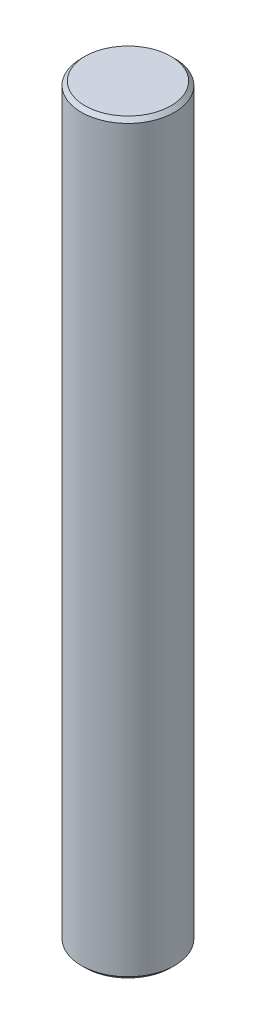
ISO-10303-21;
HEADER;
FILE_DESCRIPTION(('STEP AP214'),'2;1');
FILE_NAME('part.step','',(''),(''),'','','');
FILE_SCHEMA(('AUTOMOTIVE_DESIGN { 1 0 10303 214 1 1 1 1 }'));
ENDSEC;
DATA;
#1=APPLICATION_CONTEXT('core data for automotive mechanical design processes');
#2=APPLICATION_PROTOCOL_DEFINITION('international standard','automotive_design',2000,#1);
#3=PRODUCT_CONTEXT('',#1,'mechanical');
#4=PRODUCT('Part','Part','',(#3));
#5=PRODUCT_RELATED_PRODUCT_CATEGORY('part','',(#4));
#6=PRODUCT_DEFINITION_FORMATION('','',#4);
#7=PRODUCT_DEFINITION_CONTEXT('part definition',#1,'design');
#8=PRODUCT_DEFINITION('design','',#6,#7);
#9=PRODUCT_DEFINITION_SHAPE('','',#8);
#10=(LENGTH_UNIT() NAMED_UNIT(*) SI_UNIT(.MILLI.,.METRE.));
#11=(NAMED_UNIT(*) PLANE_ANGLE_UNIT() SI_UNIT($,.RADIAN.));
#12=(NAMED_UNIT(*) SI_UNIT($,.STERADIAN.) SOLID_ANGLE_UNIT());
#13=UNCERTAINTY_MEASURE_WITH_UNIT(LENGTH_MEASURE(1.E-05),#10,'distance_accuracy_value','');
#14=(GEOMETRIC_REPRESENTATION_CONTEXT(3) GLOBAL_UNCERTAINTY_ASSIGNED_CONTEXT((#13)) GLOBAL_UNIT_ASSIGNED_CONTEXT((#10,
#11,#12)) REPRESENTATION_CONTEXT('',''));
#15=CARTESIAN_POINT('',(0.,0.,0.));
#16=DIRECTION('',(0.,0.,1.));
#17=DIRECTION('',(1.,0.,0.));
#18=AXIS2_PLACEMENT_3D('',#15,#16,#17);
#19=CARTESIAN_POINT('',(0.,200.,0.));
#20=DIRECTION('',(0.,-1.,0.));
#21=DIRECTION('',(0.,0.,-1.));
#22=AXIS2_PLACEMENT_3D('',#19,#20,#21);
#23=CYLINDRICAL_SURFACE('',#22,12.5);
#24=CARTESIAN_POINT('',(0.,0.999999999999973,0.));
#25=DIRECTION('',(0.,1.,0.));
#26=DIRECTION('',(0.,0.,1.));
#27=AXIS2_PLACEMENT_3D('',#24,#25,#26);
#28=CIRCLE('',#27,12.5);
#29=CARTESIAN_POINT('',(0.,0.999999999999973,12.5));
#30=VERTEX_POINT('',#29);
#31=EDGE_CURVE('E50',#30,#30,#28,.T.);
#32=ORIENTED_EDGE('',*,*,#31,.T.);
#33=EDGE_LOOP('',(#32));
#34=FACE_BOUND('',#33,.T.);
#35=CARTESIAN_POINT('',(0.,199.,0.));
#36=DIRECTION('',(0.,1.,0.));
#37=DIRECTION('',(0.,0.,1.));
#38=AXIS2_PLACEMENT_3D('',#35,#36,#37);
#39=CIRCLE('',#38,12.5);
#40=CARTESIAN_POINT('',(0.,199.,12.5));
#41=VERTEX_POINT('',#40);
#42=EDGE_CURVE('E55',#41,#41,#39,.F.);
#43=ORIENTED_EDGE('',*,*,#42,.T.);
#44=EDGE_LOOP('',(#43));
#45=FACE_BOUND('',#44,.T.);
#46=ADVANCED_FACE('F37',(#34,#45),#23,.T.);
#47=CARTESIAN_POINT('',(0.,200.,0.));
#48=DIRECTION('',(0.,1.,0.));
#49=DIRECTION('',(0.,0.,1.));
#50=AXIS2_PLACEMENT_3D('',#47,#48,#49);
#51=PLANE('',#50);
#52=CARTESIAN_POINT('',(0.,200.,0.));
#53=DIRECTION('',(0.,1.,0.));
#54=DIRECTION('',(0.,0.,1.));
#55=AXIS2_PLACEMENT_3D('',#52,#53,#54);
#56=CIRCLE('',#55,11.5);
#57=CARTESIAN_POINT('',(0.,200.,11.5));
#58=VERTEX_POINT('',#57);
#59=EDGE_CURVE('E10',#58,#58,#56,.T.);
#60=ORIENTED_EDGE('',*,*,#59,.T.);
#61=EDGE_LOOP('',(#60));
#62=FACE_BOUND('',#61,.T.);
#63=ADVANCED_FACE('F72',(#62),#51,.T.);
#64=CARTESIAN_POINT('',(0.,0.,0.));
#65=DIRECTION('',(0.,1.,0.));
#66=DIRECTION('',(0.,0.,1.));
#67=AXIS2_PLACEMENT_3D('',#64,#65,#66);
#68=PLANE('',#67);
#69=CARTESIAN_POINT('',(0.,0.,0.));
#70=DIRECTION('',(0.,1.,0.));
#71=DIRECTION('',(0.,0.,1.));
#72=AXIS2_PLACEMENT_3D('',#69,#70,#71);
#73=CIRCLE('',#72,11.5);
#74=CARTESIAN_POINT('',(0.,0.,11.5));
#75=VERTEX_POINT('',#74);
#76=EDGE_CURVE('E45',#75,#75,#73,.F.);
#77=ORIENTED_EDGE('',*,*,#76,.T.);
#78=EDGE_LOOP('',(#77));
#79=FACE_BOUND('',#78,.T.);
#80=ADVANCED_FACE('F69',(#79),#68,.F.);
#81=CARTESIAN_POINT('',(0.,0.999999999999973,0.));
#82=DIRECTION('',(0.,1.,0.));
#83=DIRECTION('',(0.,0.,1.));
#84=AXIS2_PLACEMENT_3D('',#81,#82,#83);
#85=CONICAL_SURFACE('',#84,12.5,0.785398163397457);
#86=ORIENTED_EDGE('',*,*,#76,.F.);
#87=EDGE_LOOP('',(#86));
#88=FACE_BOUND('',#87,.T.);
#89=ORIENTED_EDGE('',*,*,#31,.F.);
#90=EDGE_LOOP('',(#89));
#91=FACE_BOUND('',#90,.T.);
#92=ADVANCED_FACE('F65',(#88,#91),#85,.T.);
#93=CARTESIAN_POINT('',(0.,200.,0.));
#94=DIRECTION('',(0.,-1.,0.));
#95=DIRECTION('',(0.,0.,-1.));
#96=AXIS2_PLACEMENT_3D('',#93,#94,#95);
#97=CONICAL_SURFACE('',#96,11.5,0.785398163397457);
#98=ORIENTED_EDGE('',*,*,#42,.F.);
#99=EDGE_LOOP('',(#98));
#100=FACE_BOUND('',#99,.T.);
#101=ORIENTED_EDGE('',*,*,#59,.F.);
#102=EDGE_LOOP('',(#101));
#103=FACE_BOUND('',#102,.T.);
#104=ADVANCED_FACE('F39',(#100,#103),#97,.T.);
#105=CLOSED_SHELL('',(#46,#63,#80,#92,#104));
#106=MANIFOLD_SOLID_BREP('B2',#105);
#107=ADVANCED_BREP_SHAPE_REPRESENTATION('',(#18,#106),#14);
#108=SHAPE_DEFINITION_REPRESENTATION(#9,#107);
ENDSEC;
END-ISO-10303-21;
